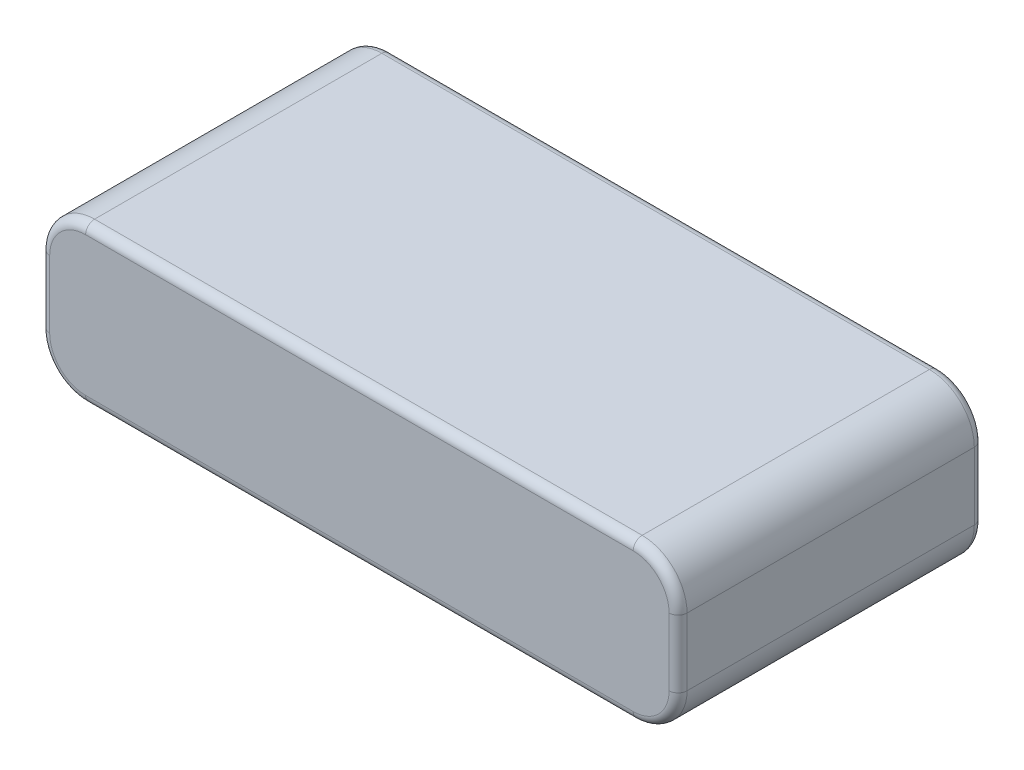
ISO-10303-21;
HEADER;
FILE_DESCRIPTION(('STEP AP214'),'2;1');
FILE_NAME('part.step','',(''),(''),'','','');
FILE_SCHEMA(('AUTOMOTIVE_DESIGN { 1 0 10303 214 1 1 1 1 }'));
ENDSEC;
DATA;
#1=APPLICATION_CONTEXT('core data for automotive mechanical design processes');
#2=APPLICATION_PROTOCOL_DEFINITION('international standard','automotive_design',2000,#1);
#3=PRODUCT_CONTEXT('',#1,'mechanical');
#4=PRODUCT('Part','Part','',(#3));
#5=PRODUCT_RELATED_PRODUCT_CATEGORY('part','',(#4));
#6=PRODUCT_DEFINITION_FORMATION('','',#4);
#7=PRODUCT_DEFINITION_CONTEXT('part definition',#1,'design');
#8=PRODUCT_DEFINITION('design','',#6,#7);
#9=PRODUCT_DEFINITION_SHAPE('','',#8);
#10=(LENGTH_UNIT() NAMED_UNIT(*) SI_UNIT(.MILLI.,.METRE.));
#11=(NAMED_UNIT(*) PLANE_ANGLE_UNIT() SI_UNIT($,.RADIAN.));
#12=(NAMED_UNIT(*) SI_UNIT($,.STERADIAN.) SOLID_ANGLE_UNIT());
#13=UNCERTAINTY_MEASURE_WITH_UNIT(LENGTH_MEASURE(1.E-05),#10,'distance_accuracy_value','');
#14=(GEOMETRIC_REPRESENTATION_CONTEXT(3) GLOBAL_UNCERTAINTY_ASSIGNED_CONTEXT((#13)) GLOBAL_UNIT_ASSIGNED_CONTEXT((#10,
#11,#12)) REPRESENTATION_CONTEXT('',''));
#15=CARTESIAN_POINT('',(0.,0.,0.));
#16=DIRECTION('',(0.,0.,1.));
#17=DIRECTION('',(1.,0.,0.));
#18=AXIS2_PLACEMENT_3D('',#15,#16,#17);
#19=CARTESIAN_POINT('',(35.5,17.5,17.));
#20=DIRECTION('',(-1.,0.,0.));
#21=DIRECTION('',(0.,0.,1.));
#22=AXIS2_PLACEMENT_3D('',#19,#20,#21);
#23=PLANE('',#22);
#24=DIRECTION('',(0.,0.,-1.));
#25=VECTOR('',#24,1.);
#26=CARTESIAN_POINT('',(35.5,5.,-17.));
#27=LINE('',#26,#25);
#28=CARTESIAN_POINT('',(35.5,5.,16.));
#29=VERTEX_POINT('',#28);
#30=CARTESIAN_POINT('',(35.5,5.,-16.));
#31=VERTEX_POINT('',#30);
#32=EDGE_CURVE('E326',#29,#31,#27,.T.);
#33=ORIENTED_EDGE('',*,*,#32,.T.);
#34=DIRECTION('',(0.,-1.,0.));
#35=VECTOR('',#34,1.);
#36=CARTESIAN_POINT('',(35.5,17.5,-16.));
#37=LINE('',#36,#35);
#38=CARTESIAN_POINT('',(35.5,12.5,-16.));
#39=VERTEX_POINT('',#38);
#40=EDGE_CURVE('E196',#31,#39,#37,.F.);
#41=ORIENTED_EDGE('',*,*,#40,.T.);
#42=DIRECTION('',(0.,0.,-1.));
#43=VECTOR('',#42,1.);
#44=CARTESIAN_POINT('',(35.5,12.5,17.));
#45=LINE('',#44,#43);
#46=CARTESIAN_POINT('',(35.5,12.5,16.));
#47=VERTEX_POINT('',#46);
#48=EDGE_CURVE('E337',#39,#47,#45,.F.);
#49=ORIENTED_EDGE('',*,*,#48,.T.);
#50=DIRECTION('',(0.,-1.,0.));
#51=VECTOR('',#50,1.);
#52=CARTESIAN_POINT('',(35.5,17.5,16.));
#53=LINE('',#52,#51);
#54=EDGE_CURVE('E193',#47,#29,#53,.T.);
#55=ORIENTED_EDGE('',*,*,#54,.T.);
#56=EDGE_LOOP('',(#33,#41,#49,#55));
#57=FACE_BOUND('',#56,.T.);
#58=ADVANCED_FACE('F39',(#57),#23,.F.);
#59=CARTESIAN_POINT('',(-35.5,17.5,-17.));
#60=DIRECTION('',(0.,0.,1.));
#61=DIRECTION('',(1.,0.,0.));
#62=AXIS2_PLACEMENT_3D('',#59,#60,#61);
#63=PLANE('',#62);
#64=DIRECTION('',(0.,-1.,0.));
#65=VECTOR('',#64,1.);
#66=CARTESIAN_POINT('',(34.5,17.5,-17.));
#67=LINE('',#66,#65);
#68=CARTESIAN_POINT('',(34.5,12.5,-17.));
#69=VERTEX_POINT('',#68);
#70=CARTESIAN_POINT('',(34.5,5.,-17.));
#71=VERTEX_POINT('',#70);
#72=EDGE_CURVE('E179',#69,#71,#67,.T.);
#73=ORIENTED_EDGE('',*,*,#72,.T.);
#74=CARTESIAN_POINT('',(30.5,5.,-17.));
#75=DIRECTION('',(0.,0.,1.));
#76=DIRECTION('',(1.,0.,0.));
#77=AXIS2_PLACEMENT_3D('',#74,#75,#76);
#78=CIRCLE('',#77,4.);
#79=CARTESIAN_POINT('',(30.5,1.,-17.));
#80=VERTEX_POINT('',#79);
#81=EDGE_CURVE('E158',#71,#80,#78,.F.);
#82=ORIENTED_EDGE('',*,*,#81,.T.);
#83=DIRECTION('',(-1.,0.,0.));
#84=VECTOR('',#83,1.);
#85=CARTESIAN_POINT('',(-30.5,1.,-17.));
#86=LINE('',#85,#84);
#87=CARTESIAN_POINT('',(-30.5,1.,-17.));
#88=VERTEX_POINT('',#87);
#89=EDGE_CURVE('E167',#80,#88,#86,.T.);
#90=ORIENTED_EDGE('',*,*,#89,.T.);
#91=CARTESIAN_POINT('',(-30.5,5.,-17.));
#92=DIRECTION('',(0.,0.,1.));
#93=DIRECTION('',(1.,0.,0.));
#94=AXIS2_PLACEMENT_3D('',#91,#92,#93);
#95=CIRCLE('',#94,4.);
#96=CARTESIAN_POINT('',(-34.5,5.,-17.));
#97=VERTEX_POINT('',#96);
#98=EDGE_CURVE('E174',#88,#97,#95,.F.);
#99=ORIENTED_EDGE('',*,*,#98,.T.);
#100=DIRECTION('',(0.,-1.,0.));
#101=VECTOR('',#100,1.);
#102=CARTESIAN_POINT('',(-34.5,17.5,-17.));
#103=LINE('',#102,#101);
#104=CARTESIAN_POINT('',(-34.5,12.5,-17.));
#105=VERTEX_POINT('',#104);
#106=EDGE_CURVE('E357',#97,#105,#103,.F.);
#107=ORIENTED_EDGE('',*,*,#106,.T.);
#108=CARTESIAN_POINT('',(-30.5,12.5,-17.));
#109=DIRECTION('',(0.,0.,1.));
#110=DIRECTION('',(1.,0.,0.));
#111=AXIS2_PLACEMENT_3D('',#108,#109,#110);
#112=CIRCLE('',#111,4.);
#113=CARTESIAN_POINT('',(-30.5,16.5,-17.));
#114=VERTEX_POINT('',#113);
#115=EDGE_CURVE('E360',#105,#114,#112,.F.);
#116=ORIENTED_EDGE('',*,*,#115,.T.);
#117=DIRECTION('',(-1.,0.,0.));
#118=VECTOR('',#117,1.);
#119=CARTESIAN_POINT('',(-35.5,16.5,-17.));
#120=LINE('',#119,#118);
#121=CARTESIAN_POINT('',(30.5,16.5,-17.));
#122=VERTEX_POINT('',#121);
#123=EDGE_CURVE('E363',#114,#122,#120,.F.);
#124=ORIENTED_EDGE('',*,*,#123,.T.);
#125=CARTESIAN_POINT('',(30.5,12.5,-17.));
#126=DIRECTION('',(0.,0.,1.));
#127=DIRECTION('',(1.,0.,0.));
#128=AXIS2_PLACEMENT_3D('',#125,#126,#127);
#129=CIRCLE('',#128,4.);
#130=EDGE_CURVE('E187',#122,#69,#129,.F.);
#131=ORIENTED_EDGE('',*,*,#130,.T.);
#132=EDGE_LOOP('',(#73,#82,#90,#99,#107,#116,#124,#131));
#133=FACE_BOUND('',#132,.T.);
#134=ADVANCED_FACE('F177',(#133),#63,.F.);
#135=CARTESIAN_POINT('',(-35.5,17.5,17.));
#136=DIRECTION('',(1.,0.,0.));
#137=DIRECTION('',(0.,0.,-1.));
#138=AXIS2_PLACEMENT_3D('',#135,#136,#137);
#139=PLANE('',#138);
#140=DIRECTION('',(0.,0.,1.));
#141=VECTOR('',#140,1.);
#142=CARTESIAN_POINT('',(-35.5,12.5,17.));
#143=LINE('',#142,#141);
#144=CARTESIAN_POINT('',(-35.5,12.5,16.));
#145=VERTEX_POINT('',#144);
#146=CARTESIAN_POINT('',(-35.5,12.5,-16.));
#147=VERTEX_POINT('',#146);
#148=EDGE_CURVE('E279',#145,#147,#143,.F.);
#149=ORIENTED_EDGE('',*,*,#148,.T.);
#150=DIRECTION('',(0.,-1.,0.));
#151=VECTOR('',#150,1.);
#152=CARTESIAN_POINT('',(-35.5,17.5,-16.));
#153=LINE('',#152,#151);
#154=CARTESIAN_POINT('',(-35.5,5.,-16.));
#155=VERTEX_POINT('',#154);
#156=EDGE_CURVE('E221',#147,#155,#153,.T.);
#157=ORIENTED_EDGE('',*,*,#156,.T.);
#158=DIRECTION('',(0.,0.,1.));
#159=VECTOR('',#158,1.);
#160=CARTESIAN_POINT('',(-35.5,5.,17.));
#161=LINE('',#160,#159);
#162=CARTESIAN_POINT('',(-35.5,5.,16.));
#163=VERTEX_POINT('',#162);
#164=EDGE_CURVE('E333',#155,#163,#161,.T.);
#165=ORIENTED_EDGE('',*,*,#164,.T.);
#166=DIRECTION('',(0.,-1.,0.));
#167=VECTOR('',#166,1.);
#168=CARTESIAN_POINT('',(-35.5,17.5,16.));
#169=LINE('',#168,#167);
#170=EDGE_CURVE('E218',#163,#145,#169,.F.);
#171=ORIENTED_EDGE('',*,*,#170,.T.);
#172=EDGE_LOOP('',(#149,#157,#165,#171));
#173=FACE_BOUND('',#172,.T.);
#174=ADVANCED_FACE('F406',(#173),#139,.F.);
#175=CARTESIAN_POINT('',(-35.5,17.5,17.));
#176=DIRECTION('',(0.,0.,-1.));
#177=DIRECTION('',(-1.,0.,0.));
#178=AXIS2_PLACEMENT_3D('',#175,#176,#177);
#179=PLANE('',#178);
#180=DIRECTION('',(1.,0.,0.));
#181=VECTOR('',#180,1.);
#182=CARTESIAN_POINT('',(-35.5,16.5,17.));
#183=LINE('',#182,#181);
#184=CARTESIAN_POINT('',(30.5,16.5,17.));
#185=VERTEX_POINT('',#184);
#186=CARTESIAN_POINT('',(-30.5,16.5,17.));
#187=VERTEX_POINT('',#186);
#188=EDGE_CURVE('E49',#185,#187,#183,.F.);
#189=ORIENTED_EDGE('',*,*,#188,.T.);
#190=CARTESIAN_POINT('',(-30.5,12.5,17.));
#191=DIRECTION('',(0.,0.,-1.));
#192=DIRECTION('',(-1.,0.,0.));
#193=AXIS2_PLACEMENT_3D('',#190,#191,#192);
#194=CIRCLE('',#193,4.);
#195=CARTESIAN_POINT('',(-34.5,12.5,17.));
#196=VERTEX_POINT('',#195);
#197=EDGE_CURVE('E11',#187,#196,#194,.F.);
#198=ORIENTED_EDGE('',*,*,#197,.T.);
#199=DIRECTION('',(0.,-1.,0.));
#200=VECTOR('',#199,1.);
#201=CARTESIAN_POINT('',(-34.5,17.5,17.));
#202=LINE('',#201,#200);
#203=CARTESIAN_POINT('',(-34.5,5.,17.));
#204=VERTEX_POINT('',#203);
#205=EDGE_CURVE('E236',#196,#204,#202,.T.);
#206=ORIENTED_EDGE('',*,*,#205,.T.);
#207=CARTESIAN_POINT('',(-30.5,5.,17.));
#208=DIRECTION('',(0.,0.,-1.));
#209=DIRECTION('',(-1.,0.,0.));
#210=AXIS2_PLACEMENT_3D('',#207,#208,#209);
#211=CIRCLE('',#210,4.);
#212=CARTESIAN_POINT('',(-30.5,1.,17.));
#213=VERTEX_POINT('',#212);
#214=EDGE_CURVE('E239',#204,#213,#211,.F.);
#215=ORIENTED_EDGE('',*,*,#214,.T.);
#216=DIRECTION('',(1.,0.,0.));
#217=VECTOR('',#216,1.);
#218=CARTESIAN_POINT('',(30.5,1.,17.));
#219=LINE('',#218,#217);
#220=CARTESIAN_POINT('',(30.5,1.,17.));
#221=VERTEX_POINT('',#220);
#222=EDGE_CURVE('E242',#213,#221,#219,.T.);
#223=ORIENTED_EDGE('',*,*,#222,.T.);
#224=CARTESIAN_POINT('',(30.5,5.,17.));
#225=DIRECTION('',(0.,0.,-1.));
#226=DIRECTION('',(-1.,0.,0.));
#227=AXIS2_PLACEMENT_3D('',#224,#225,#226);
#228=CIRCLE('',#227,4.);
#229=CARTESIAN_POINT('',(34.5,5.,17.));
#230=VERTEX_POINT('',#229);
#231=EDGE_CURVE('E245',#221,#230,#228,.F.);
#232=ORIENTED_EDGE('',*,*,#231,.T.);
#233=DIRECTION('',(0.,-1.,0.));
#234=VECTOR('',#233,1.);
#235=CARTESIAN_POINT('',(34.5,17.5,17.));
#236=LINE('',#235,#234);
#237=CARTESIAN_POINT('',(34.5,12.5,17.));
#238=VERTEX_POINT('',#237);
#239=EDGE_CURVE('E248',#230,#238,#236,.F.);
#240=ORIENTED_EDGE('',*,*,#239,.T.);
#241=CARTESIAN_POINT('',(30.5,12.5,17.));
#242=DIRECTION('',(0.,0.,-1.));
#243=DIRECTION('',(-1.,0.,0.));
#244=AXIS2_PLACEMENT_3D('',#241,#242,#243);
#245=CIRCLE('',#244,4.);
#246=EDGE_CURVE('E60',#238,#185,#245,.F.);
#247=ORIENTED_EDGE('',*,*,#246,.T.);
#248=EDGE_LOOP('',(#189,#198,#206,#215,#223,#232,#240,#247));
#249=FACE_BOUND('',#248,.T.);
#250=ADVANCED_FACE('F393',(#249),#179,.F.);
#251=CARTESIAN_POINT('',(0.,17.5,0.));
#252=DIRECTION('',(0.,-1.,0.));
#253=DIRECTION('',(0.,0.,-1.));
#254=AXIS2_PLACEMENT_3D('',#251,#252,#253);
#255=PLANE('',#254);
#256=DIRECTION('',(0.,0.,-1.));
#257=VECTOR('',#256,1.);
#258=CARTESIAN_POINT('',(30.5,17.5,0.));
#259=LINE('',#258,#257);
#260=CARTESIAN_POINT('',(30.5,17.5,16.));
#261=VERTEX_POINT('',#260);
#262=CARTESIAN_POINT('',(30.5,17.5,-16.));
#263=VERTEX_POINT('',#262);
#264=EDGE_CURVE('E175',#261,#263,#259,.T.);
#265=ORIENTED_EDGE('',*,*,#264,.T.);
#266=DIRECTION('',(-1.,0.,0.));
#267=VECTOR('',#266,1.);
#268=CARTESIAN_POINT('',(0.,17.5,-16.));
#269=LINE('',#268,#267);
#270=CARTESIAN_POINT('',(-30.5,17.5,-16.));
#271=VERTEX_POINT('',#270);
#272=EDGE_CURVE('E208',#263,#271,#269,.T.);
#273=ORIENTED_EDGE('',*,*,#272,.T.);
#274=DIRECTION('',(0.,0.,1.));
#275=VECTOR('',#274,1.);
#276=CARTESIAN_POINT('',(-30.5,17.5,0.));
#277=LINE('',#276,#275);
#278=CARTESIAN_POINT('',(-30.5,17.5,16.));
#279=VERTEX_POINT('',#278);
#280=EDGE_CURVE('E348',#271,#279,#277,.T.);
#281=ORIENTED_EDGE('',*,*,#280,.T.);
#282=DIRECTION('',(1.,0.,0.));
#283=VECTOR('',#282,1.);
#284=CARTESIAN_POINT('',(0.,17.5,16.));
#285=LINE('',#284,#283);
#286=EDGE_CURVE('E205',#279,#261,#285,.T.);
#287=ORIENTED_EDGE('',*,*,#286,.T.);
#288=EDGE_LOOP('',(#265,#273,#281,#287));
#289=FACE_BOUND('',#288,.T.);
#290=ADVANCED_FACE('F423',(#289),#255,.F.);
#291=CARTESIAN_POINT('',(0.,0.,0.));
#292=DIRECTION('',(0.,-1.,0.));
#293=DIRECTION('',(0.,0.,-1.));
#294=AXIS2_PLACEMENT_3D('',#291,#292,#293);
#295=PLANE('',#294);
#296=DIRECTION('',(0.,0.,1.));
#297=VECTOR('',#296,1.);
#298=CARTESIAN_POINT('',(-30.5,0.,-17.));
#299=LINE('',#298,#297);
#300=CARTESIAN_POINT('',(-30.5,0.,16.));
#301=VERTEX_POINT('',#300);
#302=CARTESIAN_POINT('',(-30.5,0.,-16.));
#303=VERTEX_POINT('',#302);
#304=EDGE_CURVE('E332',#301,#303,#299,.F.);
#305=ORIENTED_EDGE('',*,*,#304,.T.);
#306=DIRECTION('',(-1.,0.,0.));
#307=VECTOR('',#306,1.);
#308=CARTESIAN_POINT('',(30.5,0.,-16.));
#309=LINE('',#308,#307);
#310=CARTESIAN_POINT('',(30.5,0.,-16.));
#311=VERTEX_POINT('',#310);
#312=EDGE_CURVE('E233',#303,#311,#309,.F.);
#313=ORIENTED_EDGE('',*,*,#312,.T.);
#314=DIRECTION('',(0.,0.,-1.));
#315=VECTOR('',#314,1.);
#316=CARTESIAN_POINT('',(30.5,0.,17.));
#317=LINE('',#316,#315);
#318=CARTESIAN_POINT('',(30.5,0.,16.));
#319=VERTEX_POINT('',#318);
#320=EDGE_CURVE('E324',#311,#319,#317,.F.);
#321=ORIENTED_EDGE('',*,*,#320,.T.);
#322=DIRECTION('',(1.,0.,0.));
#323=VECTOR('',#322,1.);
#324=CARTESIAN_POINT('',(-30.5,0.,16.));
#325=LINE('',#324,#323);
#326=EDGE_CURVE('E230',#319,#301,#325,.F.);
#327=ORIENTED_EDGE('',*,*,#326,.T.);
#328=EDGE_LOOP('',(#305,#313,#321,#327));
#329=FACE_BOUND('',#328,.T.);
#330=ADVANCED_FACE('F329',(#329),#295,.T.);
#331=CARTESIAN_POINT('',(-30.5,5.,17.));
#332=DIRECTION('',(0.,0.,-1.));
#333=DIRECTION('',(-1.,0.,0.));
#334=AXIS2_PLACEMENT_3D('',#331,#332,#333);
#335=CYLINDRICAL_SURFACE('',#334,5.);
#336=ORIENTED_EDGE('',*,*,#164,.F.);
#337=CARTESIAN_POINT('',(-30.5,5.,-16.));
#338=DIRECTION('',(0.,0.,1.));
#339=DIRECTION('',(1.,0.,0.));
#340=AXIS2_PLACEMENT_3D('',#337,#338,#339);
#341=CIRCLE('',#340,5.);
#342=EDGE_CURVE('E227',#155,#303,#341,.T.);
#343=ORIENTED_EDGE('',*,*,#342,.T.);
#344=ORIENTED_EDGE('',*,*,#304,.F.);
#345=CARTESIAN_POINT('',(-30.5,5.,16.));
#346=DIRECTION('',(0.,0.,-1.));
#347=DIRECTION('',(-1.,0.,0.));
#348=AXIS2_PLACEMENT_3D('',#345,#346,#347);
#349=CIRCLE('',#348,5.);
#350=EDGE_CURVE('E224',#301,#163,#349,.T.);
#351=ORIENTED_EDGE('',*,*,#350,.T.);
#352=EDGE_LOOP('',(#336,#343,#344,#351));
#353=FACE_BOUND('',#352,.T.);
#354=ADVANCED_FACE('F430',(#353),#335,.T.);
#355=CARTESIAN_POINT('',(30.5,5.,17.));
#356=DIRECTION('',(0.,0.,1.));
#357=DIRECTION('',(1.,0.,0.));
#358=AXIS2_PLACEMENT_3D('',#355,#356,#357);
#359=CYLINDRICAL_SURFACE('',#358,5.);
#360=ORIENTED_EDGE('',*,*,#320,.F.);
#361=CARTESIAN_POINT('',(30.5,5.,-16.));
#362=DIRECTION('',(0.,0.,1.));
#363=DIRECTION('',(1.,0.,0.));
#364=AXIS2_PLACEMENT_3D('',#361,#362,#363);
#365=CIRCLE('',#364,5.);
#366=EDGE_CURVE('E160',#311,#31,#365,.T.);
#367=ORIENTED_EDGE('',*,*,#366,.T.);
#368=ORIENTED_EDGE('',*,*,#32,.F.);
#369=CARTESIAN_POINT('',(30.5,5.,16.));
#370=DIRECTION('',(0.,0.,-1.));
#371=DIRECTION('',(-1.,0.,0.));
#372=AXIS2_PLACEMENT_3D('',#369,#370,#371);
#373=CIRCLE('',#372,5.);
#374=EDGE_CURVE('E182',#29,#319,#373,.T.);
#375=ORIENTED_EDGE('',*,*,#374,.T.);
#376=EDGE_LOOP('',(#360,#367,#368,#375));
#377=FACE_BOUND('',#376,.T.);
#378=ADVANCED_FACE('F323',(#377),#359,.T.);
#379=CARTESIAN_POINT('',(30.5,12.5,0.));
#380=DIRECTION('',(0.,0.,-1.));
#381=DIRECTION('',(-1.,0.,0.));
#382=AXIS2_PLACEMENT_3D('',#379,#380,#381);
#383=CYLINDRICAL_SURFACE('',#382,5.);
#384=ORIENTED_EDGE('',*,*,#48,.F.);
#385=CARTESIAN_POINT('',(30.5,12.5,-16.));
#386=DIRECTION('',(0.,0.,1.));
#387=DIRECTION('',(1.,0.,0.));
#388=AXIS2_PLACEMENT_3D('',#385,#386,#387);
#389=CIRCLE('',#388,5.);
#390=EDGE_CURVE('E202',#39,#263,#389,.T.);
#391=ORIENTED_EDGE('',*,*,#390,.T.);
#392=ORIENTED_EDGE('',*,*,#264,.F.);
#393=CARTESIAN_POINT('',(30.5,12.5,16.));
#394=DIRECTION('',(0.,0.,-1.));
#395=DIRECTION('',(-1.,0.,0.));
#396=AXIS2_PLACEMENT_3D('',#393,#394,#395);
#397=CIRCLE('',#396,5.);
#398=EDGE_CURVE('E199',#261,#47,#397,.T.);
#399=ORIENTED_EDGE('',*,*,#398,.T.);
#400=EDGE_LOOP('',(#384,#391,#392,#399));
#401=FACE_BOUND('',#400,.T.);
#402=ADVANCED_FACE('F379',(#401),#383,.T.);
#403=CARTESIAN_POINT('',(-30.5,12.5,0.));
#404=DIRECTION('',(0.,0.,1.));
#405=DIRECTION('',(1.,0.,0.));
#406=AXIS2_PLACEMENT_3D('',#403,#404,#405);
#407=CYLINDRICAL_SURFACE('',#406,5.);
#408=ORIENTED_EDGE('',*,*,#280,.F.);
#409=CARTESIAN_POINT('',(-30.5,12.5,-16.));
#410=DIRECTION('',(0.,0.,1.));
#411=DIRECTION('',(1.,0.,0.));
#412=AXIS2_PLACEMENT_3D('',#409,#410,#411);
#413=CIRCLE('',#412,5.);
#414=EDGE_CURVE('E215',#271,#147,#413,.T.);
#415=ORIENTED_EDGE('',*,*,#414,.T.);
#416=ORIENTED_EDGE('',*,*,#148,.F.);
#417=CARTESIAN_POINT('',(-30.5,12.5,16.));
#418=DIRECTION('',(0.,0.,-1.));
#419=DIRECTION('',(-1.,0.,0.));
#420=AXIS2_PLACEMENT_3D('',#417,#418,#419);
#421=CIRCLE('',#420,5.);
#422=EDGE_CURVE('E211',#145,#279,#421,.T.);
#423=ORIENTED_EDGE('',*,*,#422,.T.);
#424=EDGE_LOOP('',(#408,#415,#416,#423));
#425=FACE_BOUND('',#424,.T.);
#426=ADVANCED_FACE('F411',(#425),#407,.T.);
#427=CARTESIAN_POINT('',(-30.5,12.5,-16.));
#428=DIRECTION('',(0.,0.,1.));
#429=DIRECTION('',(1.,0.,0.));
#430=AXIS2_PLACEMENT_3D('',#427,#428,#429);
#431=TOROIDAL_SURFACE('',#430,4.,1.);
#432=CARTESIAN_POINT('',(-34.5,12.5,-16.));
#433=DIRECTION('',(0.,-1.,0.));
#434=DIRECTION('',(0.,0.,-1.));
#435=AXIS2_PLACEMENT_3D('',#432,#433,#434);
#436=CIRCLE('',#435,1.);
#437=EDGE_CURVE('E271',#147,#105,#436,.T.);
#438=ORIENTED_EDGE('',*,*,#437,.F.);
#439=ORIENTED_EDGE('',*,*,#414,.F.);
#440=CARTESIAN_POINT('',(-30.5,16.5,-16.));
#441=DIRECTION('',(1.,0.,0.));
#442=DIRECTION('',(0.,0.,-1.));
#443=AXIS2_PLACEMENT_3D('',#440,#441,#442);
#444=CIRCLE('',#443,1.);
#445=EDGE_CURVE('E275',#114,#271,#444,.T.);
#446=ORIENTED_EDGE('',*,*,#445,.F.);
#447=ORIENTED_EDGE('',*,*,#115,.F.);
#448=EDGE_LOOP('',(#438,#439,#446,#447));
#449=FACE_BOUND('',#448,.T.);
#450=ADVANCED_FACE('F416',(#449),#431,.T.);
#451=CARTESIAN_POINT('',(0.,16.5,-16.));
#452=DIRECTION('',(-1.,0.,0.));
#453=DIRECTION('',(0.,0.,1.));
#454=AXIS2_PLACEMENT_3D('',#451,#452,#453);
#455=CYLINDRICAL_SURFACE('',#454,1.);
#456=ORIENTED_EDGE('',*,*,#445,.T.);
#457=ORIENTED_EDGE('',*,*,#272,.F.);
#458=CARTESIAN_POINT('',(30.5,16.5,-16.));
#459=DIRECTION('',(1.,0.,0.));
#460=DIRECTION('',(0.,0.,-1.));
#461=AXIS2_PLACEMENT_3D('',#458,#459,#460);
#462=CIRCLE('',#461,1.);
#463=EDGE_CURVE('E267',#122,#263,#462,.T.);
#464=ORIENTED_EDGE('',*,*,#463,.F.);
#465=ORIENTED_EDGE('',*,*,#123,.F.);
#466=EDGE_LOOP('',(#456,#457,#464,#465));
#467=FACE_BOUND('',#466,.T.);
#468=ADVANCED_FACE('F421',(#467),#455,.T.);
#469=CARTESIAN_POINT('',(-34.5,17.5,-16.));
#470=DIRECTION('',(0.,-1.,0.));
#471=DIRECTION('',(0.,0.,-1.));
#472=AXIS2_PLACEMENT_3D('',#469,#470,#471);
#473=CYLINDRICAL_SURFACE('',#472,1.);
#474=ORIENTED_EDGE('',*,*,#437,.T.);
#475=ORIENTED_EDGE('',*,*,#106,.F.);
#476=CARTESIAN_POINT('',(-34.5,5.,-16.));
#477=DIRECTION('',(0.,-1.,0.));
#478=DIRECTION('',(0.,0.,-1.));
#479=AXIS2_PLACEMENT_3D('',#476,#477,#478);
#480=CIRCLE('',#479,1.);
#481=EDGE_CURVE('E263',#155,#97,#480,.T.);
#482=ORIENTED_EDGE('',*,*,#481,.F.);
#483=ORIENTED_EDGE('',*,*,#156,.F.);
#484=EDGE_LOOP('',(#474,#475,#482,#483));
#485=FACE_BOUND('',#484,.T.);
#486=ADVANCED_FACE('F462',(#485),#473,.T.);
#487=CARTESIAN_POINT('',(30.5,12.5,-16.));
#488=DIRECTION('',(0.,0.,1.));
#489=DIRECTION('',(1.,0.,0.));
#490=AXIS2_PLACEMENT_3D('',#487,#488,#489);
#491=TOROIDAL_SURFACE('',#490,4.,1.);
#492=ORIENTED_EDGE('',*,*,#463,.T.);
#493=ORIENTED_EDGE('',*,*,#390,.F.);
#494=CARTESIAN_POINT('',(34.5,12.5,-16.));
#495=DIRECTION('',(0.,-1.,0.));
#496=DIRECTION('',(0.,0.,-1.));
#497=AXIS2_PLACEMENT_3D('',#494,#495,#496);
#498=CIRCLE('',#497,1.);
#499=EDGE_CURVE('E259',#69,#39,#498,.T.);
#500=ORIENTED_EDGE('',*,*,#499,.F.);
#501=ORIENTED_EDGE('',*,*,#130,.F.);
#502=EDGE_LOOP('',(#492,#493,#500,#501));
#503=FACE_BOUND('',#502,.T.);
#504=ADVANCED_FACE('F372',(#503),#491,.T.);
#505=CARTESIAN_POINT('',(-30.5,5.,-16.));
#506=DIRECTION('',(0.,0.,1.));
#507=DIRECTION('',(1.,0.,0.));
#508=AXIS2_PLACEMENT_3D('',#505,#506,#507);
#509=TOROIDAL_SURFACE('',#508,4.,1.);
#510=ORIENTED_EDGE('',*,*,#481,.T.);
#511=ORIENTED_EDGE('',*,*,#98,.F.);
#512=CARTESIAN_POINT('',(-30.5,1.,-16.));
#513=DIRECTION('',(1.,0.,0.));
#514=DIRECTION('',(0.,0.,-1.));
#515=AXIS2_PLACEMENT_3D('',#512,#513,#514);
#516=CIRCLE('',#515,1.);
#517=EDGE_CURVE('E170',#303,#88,#516,.T.);
#518=ORIENTED_EDGE('',*,*,#517,.F.);
#519=ORIENTED_EDGE('',*,*,#342,.F.);
#520=EDGE_LOOP('',(#510,#511,#518,#519));
#521=FACE_BOUND('',#520,.T.);
#522=ADVANCED_FACE('F456',(#521),#509,.T.);
#523=CARTESIAN_POINT('',(34.5,17.5,-16.));
#524=DIRECTION('',(0.,-1.,0.));
#525=DIRECTION('',(0.,0.,-1.));
#526=AXIS2_PLACEMENT_3D('',#523,#524,#525);
#527=CYLINDRICAL_SURFACE('',#526,1.);
#528=ORIENTED_EDGE('',*,*,#499,.T.);
#529=ORIENTED_EDGE('',*,*,#40,.F.);
#530=CARTESIAN_POINT('',(34.5,5.,-16.));
#531=DIRECTION('',(0.,-1.,0.));
#532=DIRECTION('',(0.,0.,-1.));
#533=AXIS2_PLACEMENT_3D('',#530,#531,#532);
#534=CIRCLE('',#533,1.);
#535=EDGE_CURVE('E164',#71,#31,#534,.T.);
#536=ORIENTED_EDGE('',*,*,#535,.F.);
#537=ORIENTED_EDGE('',*,*,#72,.F.);
#538=EDGE_LOOP('',(#528,#529,#536,#537));
#539=FACE_BOUND('',#538,.T.);
#540=ADVANCED_FACE('F375',(#539),#527,.T.);
#541=CARTESIAN_POINT('',(-35.5,1.,-16.));
#542=DIRECTION('',(1.,0.,0.));
#543=DIRECTION('',(0.,0.,-1.));
#544=AXIS2_PLACEMENT_3D('',#541,#542,#543);
#545=CYLINDRICAL_SURFACE('',#544,1.);
#546=ORIENTED_EDGE('',*,*,#517,.T.);
#547=ORIENTED_EDGE('',*,*,#89,.F.);
#548=CARTESIAN_POINT('',(30.5,1.,-16.));
#549=DIRECTION('',(1.,0.,0.));
#550=DIRECTION('',(0.,0.,-1.));
#551=AXIS2_PLACEMENT_3D('',#548,#549,#550);
#552=CIRCLE('',#551,1.);
#553=EDGE_CURVE('E154',#311,#80,#552,.T.);
#554=ORIENTED_EDGE('',*,*,#553,.F.);
#555=ORIENTED_EDGE('',*,*,#312,.F.);
#556=EDGE_LOOP('',(#546,#547,#554,#555));
#557=FACE_BOUND('',#556,.T.);
#558=ADVANCED_FACE('F168',(#557),#545,.T.);
#559=CARTESIAN_POINT('',(30.5,5.,-16.));
#560=DIRECTION('',(0.,0.,1.));
#561=DIRECTION('',(1.,0.,0.));
#562=AXIS2_PLACEMENT_3D('',#559,#560,#561);
#563=TOROIDAL_SURFACE('',#562,4.,1.);
#564=ORIENTED_EDGE('',*,*,#535,.T.);
#565=ORIENTED_EDGE('',*,*,#366,.F.);
#566=ORIENTED_EDGE('',*,*,#553,.T.);
#567=ORIENTED_EDGE('',*,*,#81,.F.);
#568=EDGE_LOOP('',(#564,#565,#566,#567));
#569=FACE_BOUND('',#568,.T.);
#570=ADVANCED_FACE('F156',(#569),#563,.T.);
#571=CARTESIAN_POINT('',(30.5,5.,16.));
#572=DIRECTION('',(0.,0.,-1.));
#573=DIRECTION('',(-1.,0.,0.));
#574=AXIS2_PLACEMENT_3D('',#571,#572,#573);
#575=TOROIDAL_SURFACE('',#574,4.,1.);
#576=CARTESIAN_POINT('',(30.5,1.,16.));
#577=DIRECTION('',(-1.,0.,0.));
#578=DIRECTION('',(0.,0.,1.));
#579=AXIS2_PLACEMENT_3D('',#576,#577,#578);
#580=CIRCLE('',#579,1.);
#581=EDGE_CURVE('E301',#319,#221,#580,.T.);
#582=ORIENTED_EDGE('',*,*,#581,.F.);
#583=ORIENTED_EDGE('',*,*,#374,.F.);
#584=CARTESIAN_POINT('',(34.5,5.,16.));
#585=DIRECTION('',(0.,1.,0.));
#586=DIRECTION('',(0.,0.,1.));
#587=AXIS2_PLACEMENT_3D('',#584,#585,#586);
#588=CIRCLE('',#587,1.);
#589=EDGE_CURVE('E43',#230,#29,#588,.T.);
#590=ORIENTED_EDGE('',*,*,#589,.F.);
#591=ORIENTED_EDGE('',*,*,#231,.F.);
#592=EDGE_LOOP('',(#582,#583,#590,#591));
#593=FACE_BOUND('',#592,.T.);
#594=ADVANCED_FACE('F41',(#593),#575,.T.);
#595=CARTESIAN_POINT('',(34.5,17.5,16.));
#596=DIRECTION('',(0.,-1.,0.));
#597=DIRECTION('',(0.,0.,-1.));
#598=AXIS2_PLACEMENT_3D('',#595,#596,#597);
#599=CYLINDRICAL_SURFACE('',#598,1.);
#600=ORIENTED_EDGE('',*,*,#589,.T.);
#601=ORIENTED_EDGE('',*,*,#54,.F.);
#602=CARTESIAN_POINT('',(34.5,12.5,16.));
#603=DIRECTION('',(0.,1.,0.));
#604=DIRECTION('',(0.,0.,1.));
#605=AXIS2_PLACEMENT_3D('',#602,#603,#604);
#606=CIRCLE('',#605,1.);
#607=EDGE_CURVE('E298',#238,#47,#606,.T.);
#608=ORIENTED_EDGE('',*,*,#607,.F.);
#609=ORIENTED_EDGE('',*,*,#239,.F.);
#610=EDGE_LOOP('',(#600,#601,#608,#609));
#611=FACE_BOUND('',#610,.T.);
#612=ADVANCED_FACE('F314',(#611),#599,.T.);
#613=CARTESIAN_POINT('',(-35.5,1.,16.));
#614=DIRECTION('',(-1.,0.,0.));
#615=DIRECTION('',(0.,0.,1.));
#616=AXIS2_PLACEMENT_3D('',#613,#614,#615);
#617=CYLINDRICAL_SURFACE('',#616,1.);
#618=ORIENTED_EDGE('',*,*,#581,.T.);
#619=ORIENTED_EDGE('',*,*,#222,.F.);
#620=CARTESIAN_POINT('',(-30.5,1.,16.));
#621=DIRECTION('',(-1.,0.,0.));
#622=DIRECTION('',(0.,0.,1.));
#623=AXIS2_PLACEMENT_3D('',#620,#621,#622);
#624=CIRCLE('',#623,1.);
#625=EDGE_CURVE('E294',#301,#213,#624,.T.);
#626=ORIENTED_EDGE('',*,*,#625,.F.);
#627=ORIENTED_EDGE('',*,*,#326,.F.);
#628=EDGE_LOOP('',(#618,#619,#626,#627));
#629=FACE_BOUND('',#628,.T.);
#630=ADVANCED_FACE('F480',(#629),#617,.T.);
#631=CARTESIAN_POINT('',(30.5,12.5,16.));
#632=DIRECTION('',(0.,0.,-1.));
#633=DIRECTION('',(-1.,0.,0.));
#634=AXIS2_PLACEMENT_3D('',#631,#632,#633);
#635=TOROIDAL_SURFACE('',#634,4.,1.);
#636=ORIENTED_EDGE('',*,*,#607,.T.);
#637=ORIENTED_EDGE('',*,*,#398,.F.);
#638=CARTESIAN_POINT('',(30.5,16.5,16.));
#639=DIRECTION('',(-1.,0.,0.));
#640=DIRECTION('',(0.,0.,1.));
#641=AXIS2_PLACEMENT_3D('',#638,#639,#640);
#642=CIRCLE('',#641,1.);
#643=EDGE_CURVE('E290',#185,#261,#642,.T.);
#644=ORIENTED_EDGE('',*,*,#643,.F.);
#645=ORIENTED_EDGE('',*,*,#246,.F.);
#646=EDGE_LOOP('',(#636,#637,#644,#645));
#647=FACE_BOUND('',#646,.T.);
#648=ADVANCED_FACE('F383',(#647),#635,.T.);
#649=CARTESIAN_POINT('',(-30.5,5.,16.));
#650=DIRECTION('',(0.,0.,-1.));
#651=DIRECTION('',(-1.,0.,0.));
#652=AXIS2_PLACEMENT_3D('',#649,#650,#651);
#653=TOROIDAL_SURFACE('',#652,4.,1.);
#654=ORIENTED_EDGE('',*,*,#625,.T.);
#655=ORIENTED_EDGE('',*,*,#214,.F.);
#656=CARTESIAN_POINT('',(-34.5,5.,16.));
#657=DIRECTION('',(0.,1.,0.));
#658=DIRECTION('',(0.,0.,1.));
#659=AXIS2_PLACEMENT_3D('',#656,#657,#658);
#660=CIRCLE('',#659,1.);
#661=EDGE_CURVE('E286',#163,#204,#660,.T.);
#662=ORIENTED_EDGE('',*,*,#661,.F.);
#663=ORIENTED_EDGE('',*,*,#350,.F.);
#664=EDGE_LOOP('',(#654,#655,#662,#663));
#665=FACE_BOUND('',#664,.T.);
#666=ADVANCED_FACE('F398',(#665),#653,.T.);
#667=CARTESIAN_POINT('',(0.,16.5,16.));
#668=DIRECTION('',(1.,0.,0.));
#669=DIRECTION('',(0.,0.,-1.));
#670=AXIS2_PLACEMENT_3D('',#667,#668,#669);
#671=CYLINDRICAL_SURFACE('',#670,1.);
#672=ORIENTED_EDGE('',*,*,#643,.T.);
#673=ORIENTED_EDGE('',*,*,#286,.F.);
#674=CARTESIAN_POINT('',(-30.5,16.5,16.));
#675=DIRECTION('',(-1.,0.,0.));
#676=DIRECTION('',(0.,0.,1.));
#677=AXIS2_PLACEMENT_3D('',#674,#675,#676);
#678=CIRCLE('',#677,1.);
#679=EDGE_CURVE('E283',#187,#279,#678,.T.);
#680=ORIENTED_EDGE('',*,*,#679,.F.);
#681=ORIENTED_EDGE('',*,*,#188,.F.);
#682=EDGE_LOOP('',(#672,#673,#680,#681));
#683=FACE_BOUND('',#682,.T.);
#684=ADVANCED_FACE('F386',(#683),#671,.T.);
#685=CARTESIAN_POINT('',(-34.5,17.5,16.));
#686=DIRECTION('',(0.,-1.,0.));
#687=DIRECTION('',(0.,0.,-1.));
#688=AXIS2_PLACEMENT_3D('',#685,#686,#687);
#689=CYLINDRICAL_SURFACE('',#688,1.);
#690=ORIENTED_EDGE('',*,*,#661,.T.);
#691=ORIENTED_EDGE('',*,*,#205,.F.);
#692=CARTESIAN_POINT('',(-34.5,12.5,16.));
#693=DIRECTION('',(0.,1.,0.));
#694=DIRECTION('',(0.,0.,1.));
#695=AXIS2_PLACEMENT_3D('',#692,#693,#694);
#696=CIRCLE('',#695,1.);
#697=EDGE_CURVE('E280',#145,#196,#696,.T.);
#698=ORIENTED_EDGE('',*,*,#697,.F.);
#699=ORIENTED_EDGE('',*,*,#170,.F.);
#700=EDGE_LOOP('',(#690,#691,#698,#699));
#701=FACE_BOUND('',#700,.T.);
#702=ADVANCED_FACE('F402',(#701),#689,.T.);
#703=CARTESIAN_POINT('',(-30.5,12.5,16.));
#704=DIRECTION('',(0.,0.,-1.));
#705=DIRECTION('',(-1.,0.,0.));
#706=AXIS2_PLACEMENT_3D('',#703,#704,#705);
#707=TOROIDAL_SURFACE('',#706,4.,1.);
#708=ORIENTED_EDGE('',*,*,#679,.T.);
#709=ORIENTED_EDGE('',*,*,#422,.F.);
#710=ORIENTED_EDGE('',*,*,#697,.T.);
#711=ORIENTED_EDGE('',*,*,#197,.F.);
#712=EDGE_LOOP('',(#708,#709,#710,#711));
#713=FACE_BOUND('',#712,.T.);
#714=ADVANCED_FACE('F390',(#713),#707,.T.);
#715=CLOSED_SHELL('',(#58,#134,#174,#250,#290,#330,#354,#378,#402,#426,#450,#468,#486,#504,#522,
#540,#558,#570,#594,#612,#630,#648,#666,#684,#702,#714));
#716=MANIFOLD_SOLID_BREP('B2',#715);
#717=ADVANCED_BREP_SHAPE_REPRESENTATION('',(#18,#716),#14);
#718=SHAPE_DEFINITION_REPRESENTATION(#9,#717);
ENDSEC;
END-ISO-10303-21;
